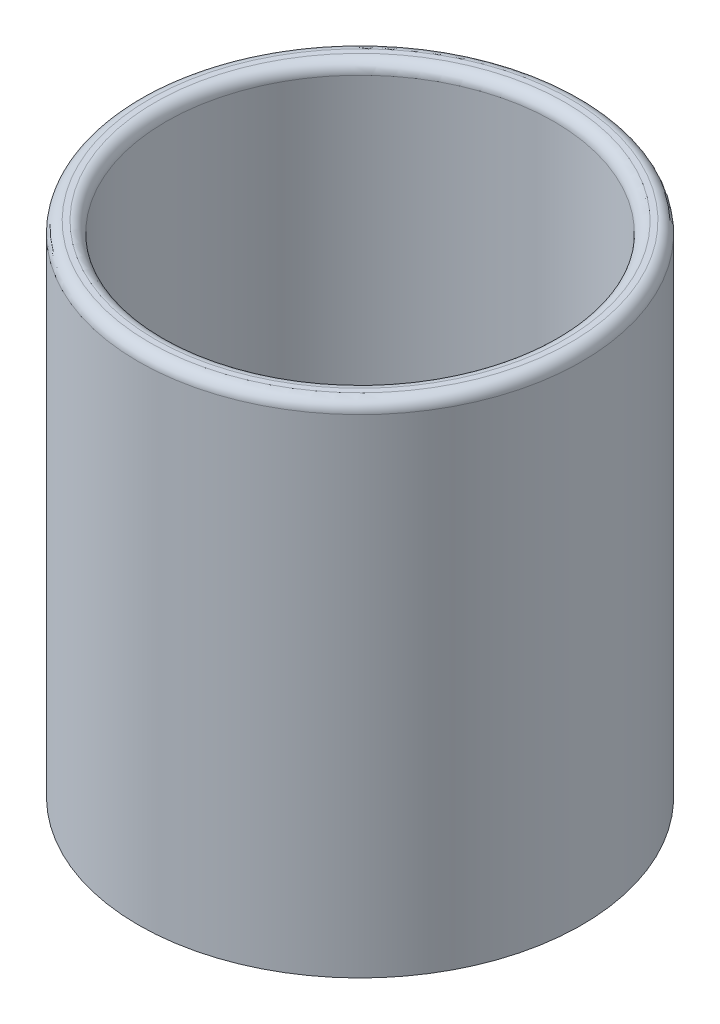
ISO-10303-21;
HEADER;
FILE_DESCRIPTION(('STEP AP214'),'2;1');
FILE_NAME('part.step','',(''),(''),'','','');
FILE_SCHEMA(('AUTOMOTIVE_DESIGN { 1 0 10303 214 1 1 1 1 }'));
ENDSEC;
DATA;
#1=APPLICATION_CONTEXT('core data for automotive mechanical design processes');
#2=APPLICATION_PROTOCOL_DEFINITION('international standard','automotive_design',2000,#1);
#3=PRODUCT_CONTEXT('',#1,'mechanical');
#4=PRODUCT('Part','Part','',(#3));
#5=PRODUCT_RELATED_PRODUCT_CATEGORY('part','',(#4));
#6=PRODUCT_DEFINITION_FORMATION('','',#4);
#7=PRODUCT_DEFINITION_CONTEXT('part definition',#1,'design');
#8=PRODUCT_DEFINITION('design','',#6,#7);
#9=PRODUCT_DEFINITION_SHAPE('','',#8);
#10=(LENGTH_UNIT() NAMED_UNIT(*) SI_UNIT(.MILLI.,.METRE.));
#11=(NAMED_UNIT(*) PLANE_ANGLE_UNIT() SI_UNIT($,.RADIAN.));
#12=(NAMED_UNIT(*) SI_UNIT($,.STERADIAN.) SOLID_ANGLE_UNIT());
#13=UNCERTAINTY_MEASURE_WITH_UNIT(LENGTH_MEASURE(1.E-05),#10,'distance_accuracy_value','');
#14=(GEOMETRIC_REPRESENTATION_CONTEXT(3) GLOBAL_UNCERTAINTY_ASSIGNED_CONTEXT((#13)) GLOBAL_UNIT_ASSIGNED_CONTEXT((#10,
#11,#12)) REPRESENTATION_CONTEXT('',''));
#15=CARTESIAN_POINT('',(0.,0.,0.));
#16=DIRECTION('',(0.,0.,1.));
#17=DIRECTION('',(1.,0.,0.));
#18=AXIS2_PLACEMENT_3D('',#15,#16,#17);
#19=CARTESIAN_POINT('',(0.,90.,0.));
#20=DIRECTION('',(0.,-1.,0.));
#21=DIRECTION('',(0.,0.,-1.));
#22=AXIS2_PLACEMENT_3D('',#19,#20,#21);
#23=CYLINDRICAL_SURFACE('',#22,40.);
#24=CARTESIAN_POINT('',(0.,88.,0.));
#25=DIRECTION('',(0.,1.,0.));
#26=DIRECTION('',(0.,0.,1.));
#27=AXIS2_PLACEMENT_3D('',#24,#25,#26);
#28=CIRCLE('',#27,40.);
#29=CARTESIAN_POINT('',(0.,88.,40.));
#30=VERTEX_POINT('',#29);
#31=EDGE_CURVE('E51',#30,#30,#28,.F.);
#32=ORIENTED_EDGE('',*,*,#31,.T.);
#33=EDGE_LOOP('',(#32));
#34=FACE_BOUND('',#33,.T.);
#35=CARTESIAN_POINT('',(0.,0.,0.));
#36=DIRECTION('',(0.,1.,0.));
#37=DIRECTION('',(0.,0.,1.));
#38=AXIS2_PLACEMENT_3D('',#35,#36,#37);
#39=CIRCLE('',#38,40.);
#40=CARTESIAN_POINT('',(0.,0.,40.));
#41=VERTEX_POINT('',#40);
#42=EDGE_CURVE('E57',#41,#41,#39,.T.);
#43=ORIENTED_EDGE('',*,*,#42,.T.);
#44=EDGE_LOOP('',(#43));
#45=FACE_BOUND('',#44,.T.);
#46=ADVANCED_FACE('F31',(#34,#45),#23,.T.);
#47=CARTESIAN_POINT('',(0.,90.,0.));
#48=DIRECTION('',(0.,1.,0.));
#49=DIRECTION('',(0.,0.,1.));
#50=AXIS2_PLACEMENT_3D('',#47,#48,#49);
#51=PLANE('',#50);
#52=CARTESIAN_POINT('',(0.,90.,0.));
#53=DIRECTION('',(0.,1.,0.));
#54=DIRECTION('',(0.,0.,1.));
#55=AXIS2_PLACEMENT_3D('',#52,#53,#54);
#56=CIRCLE('',#55,37.);
#57=CARTESIAN_POINT('',(0.,90.,37.));
#58=VERTEX_POINT('',#57);
#59=EDGE_CURVE('E42',#58,#58,#56,.F.);
#60=ORIENTED_EDGE('',*,*,#59,.T.);
#61=EDGE_LOOP('',(#60));
#62=FACE_BOUND('',#61,.T.);
#63=CARTESIAN_POINT('',(0.,90.,0.));
#64=DIRECTION('',(0.,1.,0.));
#65=DIRECTION('',(0.,0.,1.));
#66=AXIS2_PLACEMENT_3D('',#63,#64,#65);
#67=CIRCLE('',#66,38.);
#68=CARTESIAN_POINT('',(0.,90.,38.));
#69=VERTEX_POINT('',#68);
#70=EDGE_CURVE('E54',#69,#69,#67,.T.);
#71=ORIENTED_EDGE('',*,*,#70,.T.);
#72=EDGE_LOOP('',(#71));
#73=FACE_BOUND('',#72,.T.);
#74=ADVANCED_FACE('F65',(#62,#73),#51,.T.);
#75=CARTESIAN_POINT('',(0.,0.,0.));
#76=DIRECTION('',(0.,1.,0.));
#77=DIRECTION('',(0.,0.,1.));
#78=AXIS2_PLACEMENT_3D('',#75,#76,#77);
#79=PLANE('',#78);
#80=ORIENTED_EDGE('',*,*,#42,.F.);
#81=EDGE_LOOP('',(#80));
#82=FACE_BOUND('',#81,.T.);
#83=ADVANCED_FACE('F62',(#82),#79,.F.);
#84=CARTESIAN_POINT('',(0.,4.99999999999999,0.));
#85=DIRECTION('',(0.,1.,0.));
#86=DIRECTION('',(0.,0.,1.));
#87=AXIS2_PLACEMENT_3D('',#84,#85,#86);
#88=CYLINDRICAL_SURFACE('',#87,35.);
#89=CARTESIAN_POINT('',(0.,9.99999999999999,0.));
#90=DIRECTION('',(0.,1.,0.));
#91=DIRECTION('',(0.,0.,1.));
#92=AXIS2_PLACEMENT_3D('',#89,#90,#91);
#93=CIRCLE('',#92,35.);
#94=CARTESIAN_POINT('',(0.,9.99999999999999,35.));
#95=VERTEX_POINT('',#94);
#96=EDGE_CURVE('E10',#95,#95,#93,.F.);
#97=ORIENTED_EDGE('',*,*,#96,.T.);
#98=EDGE_LOOP('',(#97));
#99=FACE_BOUND('',#98,.T.);
#100=CARTESIAN_POINT('',(0.,88.,0.));
#101=DIRECTION('',(0.,1.,0.));
#102=DIRECTION('',(0.,0.,1.));
#103=AXIS2_PLACEMENT_3D('',#100,#101,#102);
#104=CIRCLE('',#103,35.);
#105=CARTESIAN_POINT('',(0.,88.,35.));
#106=VERTEX_POINT('',#105);
#107=EDGE_CURVE('E46',#106,#106,#104,.T.);
#108=ORIENTED_EDGE('',*,*,#107,.T.);
#109=EDGE_LOOP('',(#108));
#110=FACE_BOUND('',#109,.T.);
#111=ADVANCED_FACE('F64',(#99,#110),#88,.F.);
#112=CARTESIAN_POINT('',(0.,4.99999999999999,0.));
#113=DIRECTION('',(0.,1.,0.));
#114=DIRECTION('',(0.,0.,1.));
#115=AXIS2_PLACEMENT_3D('',#112,#113,#114);
#116=PLANE('',#115);
#117=CARTESIAN_POINT('',(0.,4.99999999999999,0.));
#118=DIRECTION('',(0.,1.,0.));
#119=DIRECTION('',(0.,0.,1.));
#120=AXIS2_PLACEMENT_3D('',#117,#118,#119);
#121=CIRCLE('',#120,30.);
#122=CARTESIAN_POINT('',(0.,4.99999999999999,30.));
#123=VERTEX_POINT('',#122);
#124=EDGE_CURVE('E38',#123,#123,#121,.T.);
#125=ORIENTED_EDGE('',*,*,#124,.T.);
#126=EDGE_LOOP('',(#125));
#127=FACE_BOUND('',#126,.T.);
#128=ADVANCED_FACE('F71',(#127),#116,.T.);
#129=CARTESIAN_POINT('',(0.,88.,0.));
#130=DIRECTION('',(0.,1.,0.));
#131=DIRECTION('',(0.,0.,1.));
#132=AXIS2_PLACEMENT_3D('',#129,#130,#131);
#133=TOROIDAL_SURFACE('',#132,38.,2.);
#134=ORIENTED_EDGE('',*,*,#31,.F.);
#135=EDGE_LOOP('',(#134));
#136=FACE_BOUND('',#135,.T.);
#137=ORIENTED_EDGE('',*,*,#70,.F.);
#138=EDGE_LOOP('',(#137));
#139=FACE_BOUND('',#138,.T.);
#140=ADVANCED_FACE('F81',(#136,#139),#133,.T.);
#141=CARTESIAN_POINT('',(0.,88.,0.));
#142=DIRECTION('',(0.,1.,0.));
#143=DIRECTION('',(0.,0.,1.));
#144=AXIS2_PLACEMENT_3D('',#141,#142,#143);
#145=TOROIDAL_SURFACE('',#144,37.,2.);
#146=ORIENTED_EDGE('',*,*,#59,.F.);
#147=EDGE_LOOP('',(#146));
#148=FACE_BOUND('',#147,.T.);
#149=ORIENTED_EDGE('',*,*,#107,.F.);
#150=EDGE_LOOP('',(#149));
#151=FACE_BOUND('',#150,.T.);
#152=ADVANCED_FACE('F83',(#148,#151),#145,.T.);
#153=CARTESIAN_POINT('',(0.,9.99999999999999,0.));
#154=DIRECTION('',(0.,1.,0.));
#155=DIRECTION('',(0.,0.,1.));
#156=AXIS2_PLACEMENT_3D('',#153,#154,#155);
#157=TOROIDAL_SURFACE('',#156,30.,5.);
#158=ORIENTED_EDGE('',*,*,#96,.F.);
#159=EDGE_LOOP('',(#158));
#160=FACE_BOUND('',#159,.T.);
#161=ORIENTED_EDGE('',*,*,#124,.F.);
#162=EDGE_LOOP('',(#161));
#163=FACE_BOUND('',#162,.T.);
#164=ADVANCED_FACE('F33',(#160,#163),#157,.F.);
#165=CLOSED_SHELL('',(#46,#74,#83,#111,#128,#140,#152,#164));
#166=MANIFOLD_SOLID_BREP('B2',#165);
#167=ADVANCED_BREP_SHAPE_REPRESENTATION('',(#18,#166),#14);
#168=SHAPE_DEFINITION_REPRESENTATION(#9,#167);
ENDSEC;
END-ISO-10303-21;
